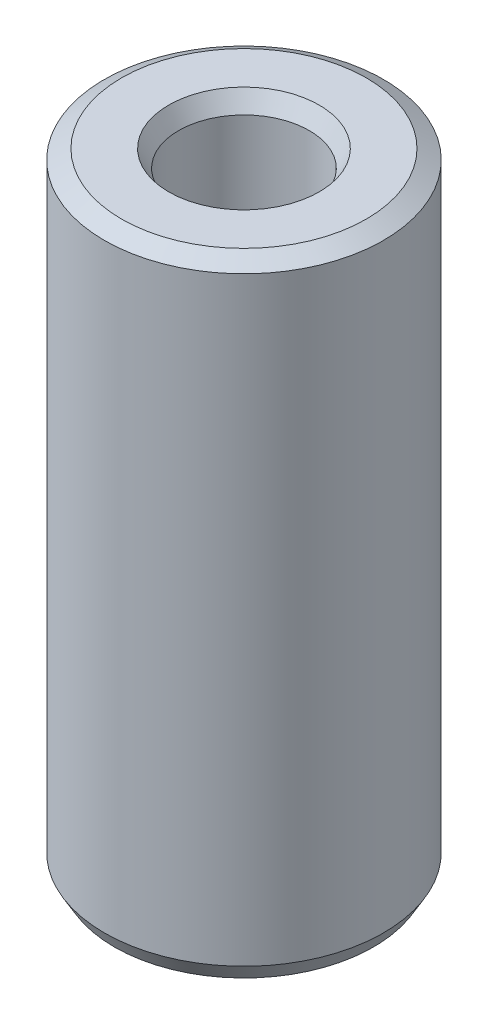
ISO-10303-21;
HEADER;
FILE_DESCRIPTION(('STEP AP214'),'2;1');
FILE_NAME('part.step','',(''),(''),'','','');
FILE_SCHEMA(('AUTOMOTIVE_DESIGN { 1 0 10303 214 1 1 1 1 }'));
ENDSEC;
DATA;
#1=APPLICATION_CONTEXT('core data for automotive mechanical design processes');
#2=APPLICATION_PROTOCOL_DEFINITION('international standard','automotive_design',2000,#1);
#3=PRODUCT_CONTEXT('',#1,'mechanical');
#4=PRODUCT('Part','Part','',(#3));
#5=PRODUCT_RELATED_PRODUCT_CATEGORY('part','',(#4));
#6=PRODUCT_DEFINITION_FORMATION('','',#4);
#7=PRODUCT_DEFINITION_CONTEXT('part definition',#1,'design');
#8=PRODUCT_DEFINITION('design','',#6,#7);
#9=PRODUCT_DEFINITION_SHAPE('','',#8);
#10=(LENGTH_UNIT() NAMED_UNIT(*) SI_UNIT(.MILLI.,.METRE.));
#11=(NAMED_UNIT(*) PLANE_ANGLE_UNIT() SI_UNIT($,.RADIAN.));
#12=(NAMED_UNIT(*) SI_UNIT($,.STERADIAN.) SOLID_ANGLE_UNIT());
#13=UNCERTAINTY_MEASURE_WITH_UNIT(LENGTH_MEASURE(1.E-05),#10,'distance_accuracy_value','');
#14=(GEOMETRIC_REPRESENTATION_CONTEXT(3) GLOBAL_UNCERTAINTY_ASSIGNED_CONTEXT((#13)) GLOBAL_UNIT_ASSIGNED_CONTEXT((#10,
#11,#12)) REPRESENTATION_CONTEXT('',''));
#15=CARTESIAN_POINT('',(0.,0.,0.));
#16=DIRECTION('',(0.,0.,1.));
#17=DIRECTION('',(1.,0.,0.));
#18=AXIS2_PLACEMENT_3D('',#15,#16,#17);
#19=CARTESIAN_POINT('',(0.,157.239863962405,0.));
#20=DIRECTION('',(0.,-1.,0.));
#21=DIRECTION('',(0.,0.,-1.));
#22=AXIS2_PLACEMENT_3D('',#19,#20,#21);
#23=CYLINDRICAL_SURFACE('',#22,35.);
#24=CARTESIAN_POINT('',(0.,4.3016271444879,0.));
#25=DIRECTION('',(0.,1.,0.));
#26=DIRECTION('',(0.,0.,1.));
#27=AXIS2_PLACEMENT_3D('',#24,#25,#26);
#28=CIRCLE('',#27,35.);
#29=CARTESIAN_POINT('',(0.,4.3016271444879,35.));
#30=VERTEX_POINT('',#29);
#31=EDGE_CURVE('E10',#30,#30,#28,.T.);
#32=ORIENTED_EDGE('',*,*,#31,.T.);
#33=EDGE_LOOP('',(#32));
#34=FACE_BOUND('',#33,.T.);
#35=CARTESIAN_POINT('',(0.,154.756318372582,0.));
#36=DIRECTION('',(0.,1.,0.));
#37=DIRECTION('',(0.,0.,1.));
#38=AXIS2_PLACEMENT_3D('',#35,#36,#37);
#39=CIRCLE('',#38,35.);
#40=CARTESIAN_POINT('',(0.,154.756318372582,35.));
#41=VERTEX_POINT('',#40);
#42=EDGE_CURVE('E50',#41,#41,#39,.F.);
#43=ORIENTED_EDGE('',*,*,#42,.T.);
#44=EDGE_LOOP('',(#43));
#45=FACE_BOUND('',#44,.T.);
#46=ADVANCED_FACE('F39',(#34,#45),#23,.T.);
#47=CARTESIAN_POINT('',(0.,157.239863962405,0.));
#48=DIRECTION('',(0.,1.,0.));
#49=DIRECTION('',(0.,0.,1.));
#50=AXIS2_PLACEMENT_3D('',#47,#48,#49);
#51=PLANE('',#50);
#52=CARTESIAN_POINT('',(0.,157.239863962405,0.));
#53=DIRECTION('',(0.,1.,0.));
#54=DIRECTION('',(0.,0.,1.));
#55=AXIS2_PLACEMENT_3D('',#52,#53,#54);
#56=CIRCLE('',#55,18.8781317688764);
#57=CARTESIAN_POINT('',(0.,157.239863962405,18.8781317688764));
#58=VERTEX_POINT('',#57);
#59=EDGE_CURVE('E58',#58,#58,#56,.F.);
#60=ORIENTED_EDGE('',*,*,#59,.T.);
#61=EDGE_LOOP('',(#60));
#62=FACE_BOUND('',#61,.T.);
#63=CARTESIAN_POINT('',(0.,157.239863962405,0.));
#64=DIRECTION('',(0.,1.,0.));
#65=DIRECTION('',(0.,0.,1.));
#66=AXIS2_PLACEMENT_3D('',#63,#64,#65);
#67=CIRCLE('',#66,30.6983728555122);
#68=CARTESIAN_POINT('',(0.,157.239863962405,30.6983728555122));
#69=VERTEX_POINT('',#68);
#70=EDGE_CURVE('E61',#69,#69,#67,.T.);
#71=ORIENTED_EDGE('',*,*,#70,.T.);
#72=EDGE_LOOP('',(#71));
#73=FACE_BOUND('',#72,.T.);
#74=ADVANCED_FACE('F88',(#62,#73),#51,.T.);
#75=CARTESIAN_POINT('',(0.,0.,0.));
#76=DIRECTION('',(0.,1.,0.));
#77=DIRECTION('',(0.,0.,1.));
#78=AXIS2_PLACEMENT_3D('',#75,#76,#77);
#79=PLANE('',#78);
#80=CARTESIAN_POINT('',(0.,0.,0.));
#81=DIRECTION('',(0.,1.,0.));
#82=DIRECTION('',(0.,0.,1.));
#83=AXIS2_PLACEMENT_3D('',#80,#81,#82);
#84=CIRCLE('',#83,20.6962133235408);
#85=CARTESIAN_POINT('',(0.,0.,20.6962133235408));
#86=VERTEX_POINT('',#85);
#87=EDGE_CURVE('E51',#86,#86,#84,.T.);
#88=ORIENTED_EDGE('',*,*,#87,.T.);
#89=EDGE_LOOP('',(#88));
#90=FACE_BOUND('',#89,.T.);
#91=CARTESIAN_POINT('',(0.,0.,0.));
#92=DIRECTION('',(0.,1.,0.));
#93=DIRECTION('',(0.,0.,1.));
#94=AXIS2_PLACEMENT_3D('',#91,#92,#93);
#95=CIRCLE('',#94,32.5164544101765);
#96=CARTESIAN_POINT('',(0.,0.,32.5164544101765));
#97=VERTEX_POINT('',#96);
#98=EDGE_CURVE('E54',#97,#97,#95,.F.);
#99=ORIENTED_EDGE('',*,*,#98,.T.);
#100=EDGE_LOOP('',(#99));
#101=FACE_BOUND('',#100,.T.);
#102=ADVANCED_FACE('F83',(#90,#101),#79,.F.);
#103=CARTESIAN_POINT('',(0.,157.239863962405,0.));
#104=DIRECTION('',(0.,-1.,0.));
#105=DIRECTION('',(0.,0.,-1.));
#106=AXIS2_PLACEMENT_3D('',#103,#104,#105);
#107=CYLINDRICAL_SURFACE('',#106,16.3945861790529);
#108=CARTESIAN_POINT('',(0.,152.938236817917,0.));
#109=DIRECTION('',(0.,1.,0.));
#110=DIRECTION('',(0.,0.,1.));
#111=AXIS2_PLACEMENT_3D('',#108,#109,#110);
#112=CIRCLE('',#111,16.3945861790529);
#113=CARTESIAN_POINT('',(0.,152.938236817917,16.3945861790529));
#114=VERTEX_POINT('',#113);
#115=EDGE_CURVE('E67',#114,#114,#112,.T.);
#116=ORIENTED_EDGE('',*,*,#115,.T.);
#117=EDGE_LOOP('',(#116));
#118=FACE_BOUND('',#117,.T.);
#119=CARTESIAN_POINT('',(0.,2.48354558982347,0.));
#120=DIRECTION('',(0.,1.,0.));
#121=DIRECTION('',(0.,0.,1.));
#122=AXIS2_PLACEMENT_3D('',#119,#120,#121);
#123=CIRCLE('',#122,16.3945861790529);
#124=CARTESIAN_POINT('',(0.,2.48354558982347,16.3945861790529));
#125=VERTEX_POINT('',#124);
#126=EDGE_CURVE('E69',#125,#125,#123,.F.);
#127=ORIENTED_EDGE('',*,*,#126,.T.);
#128=EDGE_LOOP('',(#127));
#129=FACE_BOUND('',#128,.T.);
#130=ADVANCED_FACE('F71',(#118,#129),#107,.F.);
#131=CARTESIAN_POINT('',(0.,152.938236817917,0.));
#132=DIRECTION('',(0.,1.,0.));
#133=DIRECTION('',(0.,0.,1.));
#134=AXIS2_PLACEMENT_3D('',#131,#132,#133);
#135=CONICAL_SURFACE('',#134,16.3945861790529,0.523598775598303);
#136=ORIENTED_EDGE('',*,*,#59,.F.);
#137=EDGE_LOOP('',(#136));
#138=FACE_BOUND('',#137,.T.);
#139=ORIENTED_EDGE('',*,*,#115,.F.);
#140=EDGE_LOOP('',(#139));
#141=FACE_BOUND('',#140,.T.);
#142=ADVANCED_FACE('F77',(#138,#141),#135,.F.);
#143=CARTESIAN_POINT('',(0.,0.,0.));
#144=DIRECTION('',(0.,-1.,0.));
#145=DIRECTION('',(0.,0.,-1.));
#146=AXIS2_PLACEMENT_3D('',#143,#144,#145);
#147=CONICAL_SURFACE('',#146,20.6962133235408,1.0471975511966);
#148=ORIENTED_EDGE('',*,*,#126,.F.);
#149=EDGE_LOOP('',(#148));
#150=FACE_BOUND('',#149,.T.);
#151=ORIENTED_EDGE('',*,*,#87,.F.);
#152=EDGE_LOOP('',(#151));
#153=FACE_BOUND('',#152,.T.);
#154=ADVANCED_FACE('F73',(#150,#153),#147,.F.);
#155=CARTESIAN_POINT('',(0.,4.3016271444879,0.));
#156=DIRECTION('',(0.,1.,0.));
#157=DIRECTION('',(0.,0.,1.));
#158=AXIS2_PLACEMENT_3D('',#155,#156,#157);
#159=CONICAL_SURFACE('',#158,35.,0.523598775598304);
#160=ORIENTED_EDGE('',*,*,#98,.F.);
#161=EDGE_LOOP('',(#160));
#162=FACE_BOUND('',#161,.T.);
#163=ORIENTED_EDGE('',*,*,#31,.F.);
#164=EDGE_LOOP('',(#163));
#165=FACE_BOUND('',#164,.T.);
#166=ADVANCED_FACE('F76',(#162,#165),#159,.T.);
#167=CARTESIAN_POINT('',(0.,157.239863962405,0.));
#168=DIRECTION('',(0.,-1.,0.));
#169=DIRECTION('',(0.,0.,-1.));
#170=AXIS2_PLACEMENT_3D('',#167,#168,#169);
#171=CONICAL_SURFACE('',#170,30.6983728555122,1.0471975511966);
#172=ORIENTED_EDGE('',*,*,#42,.F.);
#173=EDGE_LOOP('',(#172));
#174=FACE_BOUND('',#173,.T.);
#175=ORIENTED_EDGE('',*,*,#70,.F.);
#176=EDGE_LOOP('',(#175));
#177=FACE_BOUND('',#176,.T.);
#178=ADVANCED_FACE('F45',(#174,#177),#171,.T.);
#179=CLOSED_SHELL('',(#46,#74,#102,#130,#142,#154,#166,#178));
#180=MANIFOLD_SOLID_BREP('B2',#179);
#181=ADVANCED_BREP_SHAPE_REPRESENTATION('',(#18,#180),#14);
#182=SHAPE_DEFINITION_REPRESENTATION(#9,#181);
ENDSEC;
END-ISO-10303-21;
